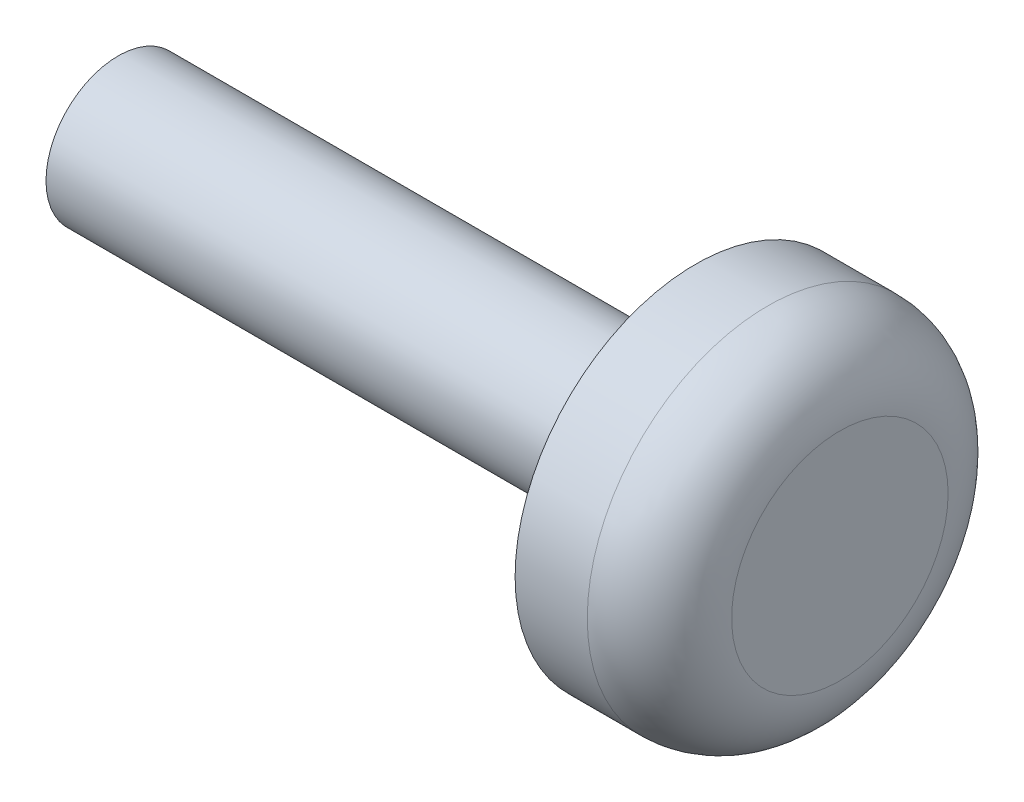
ISO-10303-21;
HEADER;
FILE_DESCRIPTION(('STEP AP214'),'2;1');
FILE_NAME('part.step','',(''),(''),'','','');
FILE_SCHEMA(('AUTOMOTIVE_DESIGN { 1 0 10303 214 1 1 1 1 }'));
ENDSEC;
DATA;
#1=APPLICATION_CONTEXT('core data for automotive mechanical design processes');
#2=APPLICATION_PROTOCOL_DEFINITION('international standard','automotive_design',2000,#1);
#3=PRODUCT_CONTEXT('',#1,'mechanical');
#4=PRODUCT('Part','Part','',(#3));
#5=PRODUCT_RELATED_PRODUCT_CATEGORY('part','',(#4));
#6=PRODUCT_DEFINITION_FORMATION('','',#4);
#7=PRODUCT_DEFINITION_CONTEXT('part definition',#1,'design');
#8=PRODUCT_DEFINITION('design','',#6,#7);
#9=PRODUCT_DEFINITION_SHAPE('','',#8);
#10=(LENGTH_UNIT() NAMED_UNIT(*) SI_UNIT(.MILLI.,.METRE.));
#11=(NAMED_UNIT(*) PLANE_ANGLE_UNIT() SI_UNIT($,.RADIAN.));
#12=(NAMED_UNIT(*) SI_UNIT($,.STERADIAN.) SOLID_ANGLE_UNIT());
#13=UNCERTAINTY_MEASURE_WITH_UNIT(LENGTH_MEASURE(1.E-05),#10,'distance_accuracy_value','');
#14=(GEOMETRIC_REPRESENTATION_CONTEXT(3) GLOBAL_UNCERTAINTY_ASSIGNED_CONTEXT((#13)) GLOBAL_UNIT_ASSIGNED_CONTEXT((#10,
#11,#12)) REPRESENTATION_CONTEXT('',''));
#15=CARTESIAN_POINT('',(0.,0.,0.));
#16=DIRECTION('',(0.,0.,1.));
#17=DIRECTION('',(1.,0.,0.));
#18=AXIS2_PLACEMENT_3D('',#15,#16,#17);
#19=CARTESIAN_POINT('',(2.,0.,0.));
#20=DIRECTION('',(-1.,0.,0.));
#21=DIRECTION('',(0.,0.,1.));
#22=AXIS2_PLACEMENT_3D('',#19,#20,#21);
#23=CYLINDRICAL_SURFACE('',#22,2.5);
#24=CARTESIAN_POINT('',(1.,0.,0.));
#25=DIRECTION('',(1.,0.,0.));
#26=DIRECTION('',(0.,0.,-1.));
#27=AXIS2_PLACEMENT_3D('',#24,#25,#26);
#28=CIRCLE('',#27,2.5);
#29=CARTESIAN_POINT('',(1.,0.,-2.5));
#30=VERTEX_POINT('',#29);
#31=EDGE_CURVE('E10',#30,#30,#28,.F.);
#32=ORIENTED_EDGE('',*,*,#31,.T.);
#33=EDGE_LOOP('',(#32));
#34=FACE_BOUND('',#33,.T.);
#35=CARTESIAN_POINT('',(0.,0.,0.));
#36=DIRECTION('',(1.,0.,0.));
#37=DIRECTION('',(0.,0.,-1.));
#38=AXIS2_PLACEMENT_3D('',#35,#36,#37);
#39=CIRCLE('',#38,2.5);
#40=CARTESIAN_POINT('',(0.,0.,-2.5));
#41=VERTEX_POINT('',#40);
#42=EDGE_CURVE('E49',#41,#41,#39,.T.);
#43=ORIENTED_EDGE('',*,*,#42,.T.);
#44=EDGE_LOOP('',(#43));
#45=FACE_BOUND('',#44,.T.);
#46=ADVANCED_FACE('F34',(#34,#45),#23,.T.);
#47=CARTESIAN_POINT('',(2.,0.,0.));
#48=DIRECTION('',(1.,0.,0.));
#49=DIRECTION('',(0.,0.,-1.));
#50=AXIS2_PLACEMENT_3D('',#47,#48,#49);
#51=PLANE('',#50);
#52=CARTESIAN_POINT('',(2.,0.,0.));
#53=DIRECTION('',(1.,0.,0.));
#54=DIRECTION('',(0.,0.,-1.));
#55=AXIS2_PLACEMENT_3D('',#52,#53,#54);
#56=CIRCLE('',#55,1.5);
#57=CARTESIAN_POINT('',(2.,0.,-1.5));
#58=VERTEX_POINT('',#57);
#59=EDGE_CURVE('E41',#58,#58,#56,.T.);
#60=ORIENTED_EDGE('',*,*,#59,.T.);
#61=EDGE_LOOP('',(#60));
#62=FACE_BOUND('',#61,.T.);
#63=ADVANCED_FACE('F69',(#62),#51,.T.);
#64=CARTESIAN_POINT('',(0.,0.,0.));
#65=DIRECTION('',(1.,0.,0.));
#66=DIRECTION('',(0.,0.,-1.));
#67=AXIS2_PLACEMENT_3D('',#64,#65,#66);
#68=PLANE('',#67);
#69=CARTESIAN_POINT('',(0.,0.,0.));
#70=DIRECTION('',(-1.,0.,0.));
#71=DIRECTION('',(0.,0.,1.));
#72=AXIS2_PLACEMENT_3D('',#69,#70,#71);
#73=CIRCLE('',#72,1.);
#74=CARTESIAN_POINT('',(0.,0.,1.));
#75=VERTEX_POINT('',#74);
#76=EDGE_CURVE('E45',#75,#75,#73,.T.);
#77=ORIENTED_EDGE('',*,*,#76,.F.);
#78=EDGE_LOOP('',(#77));
#79=FACE_BOUND('',#78,.T.);
#80=ORIENTED_EDGE('',*,*,#42,.F.);
#81=EDGE_LOOP('',(#80));
#82=FACE_BOUND('',#81,.T.);
#83=ADVANCED_FACE('F63',(#79,#82),#68,.F.);
#84=CARTESIAN_POINT('',(-8.,0.,0.));
#85=DIRECTION('',(1.,0.,0.));
#86=DIRECTION('',(0.,0.,-1.));
#87=AXIS2_PLACEMENT_3D('',#84,#85,#86);
#88=CYLINDRICAL_SURFACE('',#87,1.);
#89=CARTESIAN_POINT('',(-8.,0.,0.));
#90=DIRECTION('',(-1.,0.,0.));
#91=DIRECTION('',(0.,0.,1.));
#92=AXIS2_PLACEMENT_3D('',#89,#90,#91);
#93=CIRCLE('',#92,1.);
#94=CARTESIAN_POINT('',(-8.,0.,1.));
#95=VERTEX_POINT('',#94);
#96=EDGE_CURVE('E53',#95,#95,#93,.T.);
#97=ORIENTED_EDGE('',*,*,#96,.F.);
#98=EDGE_LOOP('',(#97));
#99=FACE_BOUND('',#98,.T.);
#100=ORIENTED_EDGE('',*,*,#76,.T.);
#101=EDGE_LOOP('',(#100));
#102=FACE_BOUND('',#101,.T.);
#103=ADVANCED_FACE('F60',(#99,#102),#88,.T.);
#104=CARTESIAN_POINT('',(-8.,0.,0.));
#105=DIRECTION('',(-1.,0.,0.));
#106=DIRECTION('',(0.,0.,1.));
#107=AXIS2_PLACEMENT_3D('',#104,#105,#106);
#108=PLANE('',#107);
#109=ORIENTED_EDGE('',*,*,#96,.T.);
#110=EDGE_LOOP('',(#109));
#111=FACE_BOUND('',#110,.T.);
#112=ADVANCED_FACE('F58',(#111),#108,.T.);
#113=CARTESIAN_POINT('',(1.,0.,0.));
#114=DIRECTION('',(1.,0.,0.));
#115=DIRECTION('',(0.,0.,-1.));
#116=AXIS2_PLACEMENT_3D('',#113,#114,#115);
#117=TOROIDAL_SURFACE('',#116,1.5,1.);
#118=ORIENTED_EDGE('',*,*,#31,.F.);
#119=EDGE_LOOP('',(#118));
#120=FACE_BOUND('',#119,.T.);
#121=ORIENTED_EDGE('',*,*,#59,.F.);
#122=EDGE_LOOP('',(#121));
#123=FACE_BOUND('',#122,.T.);
#124=ADVANCED_FACE('F36',(#120,#123),#117,.T.);
#125=CLOSED_SHELL('',(#46,#63,#83,#103,#112,#124));
#126=MANIFOLD_SOLID_BREP('B2',#125);
#127=ADVANCED_BREP_SHAPE_REPRESENTATION('',(#18,#126),#14);
#128=SHAPE_DEFINITION_REPRESENTATION(#9,#127);
ENDSEC;
END-ISO-10303-21;
